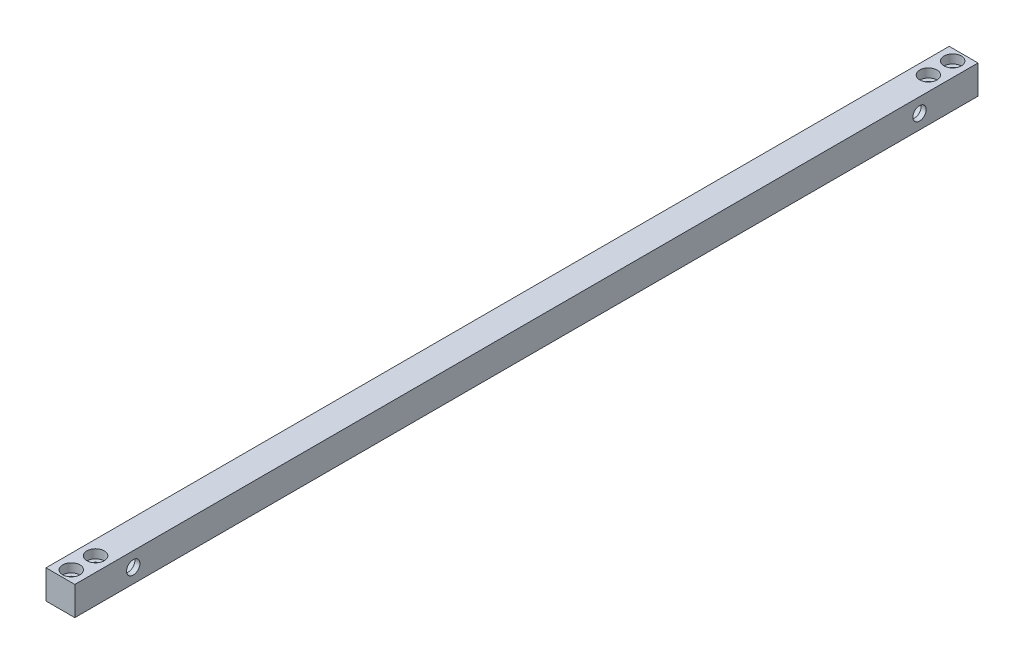
ISO-10303-21;
HEADER;
FILE_DESCRIPTION(('STEP AP214'),'2;1');
FILE_NAME('part.step','',(''),(''),'','','');
FILE_SCHEMA(('AUTOMOTIVE_DESIGN { 1 0 10303 214 1 1 1 1 }'));
ENDSEC;
DATA;
#1=APPLICATION_CONTEXT('core data for automotive mechanical design processes');
#2=APPLICATION_PROTOCOL_DEFINITION('international standard','automotive_design',2000,#1);
#3=PRODUCT_CONTEXT('',#1,'mechanical');
#4=PRODUCT('Part','Part','',(#3));
#5=PRODUCT_RELATED_PRODUCT_CATEGORY('part','',(#4));
#6=PRODUCT_DEFINITION_FORMATION('','',#4);
#7=PRODUCT_DEFINITION_CONTEXT('part definition',#1,'design');
#8=PRODUCT_DEFINITION('design','',#6,#7);
#9=PRODUCT_DEFINITION_SHAPE('','',#8);
#10=(LENGTH_UNIT() NAMED_UNIT(*) SI_UNIT(.MILLI.,.METRE.));
#11=(NAMED_UNIT(*) PLANE_ANGLE_UNIT() SI_UNIT($,.RADIAN.));
#12=(NAMED_UNIT(*) SI_UNIT($,.STERADIAN.) SOLID_ANGLE_UNIT());
#13=UNCERTAINTY_MEASURE_WITH_UNIT(LENGTH_MEASURE(1.E-05),#10,'distance_accuracy_value','');
#14=(GEOMETRIC_REPRESENTATION_CONTEXT(3) GLOBAL_UNCERTAINTY_ASSIGNED_CONTEXT((#13)) GLOBAL_UNIT_ASSIGNED_CONTEXT((#10,
#11,#12)) REPRESENTATION_CONTEXT('',''));
#15=CARTESIAN_POINT('',(0.,0.,0.));
#16=DIRECTION('',(0.,0.,1.));
#17=DIRECTION('',(1.,0.,0.));
#18=AXIS2_PLACEMENT_3D('',#15,#16,#17);
#19=CARTESIAN_POINT('',(0.,0.,497.84));
#20=DIRECTION('',(1.,0.,0.));
#21=DIRECTION('',(0.,1.,0.));
#22=AXIS2_PLACEMENT_3D('',#19,#20,#21);
#23=PLANE('',#22);
#24=CARTESIAN_POINT('',(0.,7.93749999999994,32.2199));
#25=DIRECTION('',(-1.,0.,0.));
#26=DIRECTION('',(0.,1.,0.));
#27=AXIS2_PLACEMENT_3D('',#24,#25,#26);
#28=CIRCLE('',#27,6.81989999999997);
#29=CARTESIAN_POINT('',(0.,14.7573999999999,32.2199));
#30=VERTEX_POINT('',#29);
#31=EDGE_CURVE('E162',#30,#30,#28,.T.);
#32=ORIENTED_EDGE('',*,*,#31,.F.);
#33=EDGE_LOOP('',(#32));
#34=FACE_BOUND('',#33,.T.);
#35=CARTESIAN_POINT('',(0.,7.9375,465.6201));
#36=DIRECTION('',(-1.,0.,0.));
#37=DIRECTION('',(0.,-1.,0.));
#38=AXIS2_PLACEMENT_3D('',#35,#36,#37);
#39=CIRCLE('',#38,6.81989999999997);
#40=CARTESIAN_POINT('',(0.,1.11760000000003,465.6201));
#41=VERTEX_POINT('',#40);
#42=EDGE_CURVE('E166',#41,#41,#39,.T.);
#43=ORIENTED_EDGE('',*,*,#42,.F.);
#44=EDGE_LOOP('',(#43));
#45=FACE_BOUND('',#44,.T.);
#46=DIRECTION('',(0.,-1.,0.));
#47=VECTOR('',#46,1.);
#48=CARTESIAN_POINT('',(0.,0.,0.));
#49=LINE('',#48,#47);
#50=CARTESIAN_POINT('',(0.,15.875,0.));
#51=VERTEX_POINT('',#50);
#52=CARTESIAN_POINT('',(0.,0.,0.));
#53=VERTEX_POINT('',#52);
#54=EDGE_CURVE('E103',#51,#53,#49,.T.);
#55=ORIENTED_EDGE('',*,*,#54,.T.);
#56=DIRECTION('',(0.,0.,-1.));
#57=VECTOR('',#56,1.);
#58=CARTESIAN_POINT('',(0.,0.,497.84));
#59=LINE('',#58,#57);
#60=CARTESIAN_POINT('',(0.,0.,497.84));
#61=VERTEX_POINT('',#60);
#62=EDGE_CURVE('E11',#61,#53,#59,.T.);
#63=ORIENTED_EDGE('',*,*,#62,.F.);
#64=DIRECTION('',(0.,-1.,0.));
#65=VECTOR('',#64,1.);
#66=CARTESIAN_POINT('',(0.,0.,497.84));
#67=LINE('',#66,#65);
#68=CARTESIAN_POINT('',(0.,15.875,497.84));
#69=VERTEX_POINT('',#68);
#70=EDGE_CURVE('E90',#69,#61,#67,.T.);
#71=ORIENTED_EDGE('',*,*,#70,.F.);
#72=DIRECTION('',(0.,0.,-1.));
#73=VECTOR('',#72,1.);
#74=CARTESIAN_POINT('',(0.,15.875,497.84));
#75=LINE('',#74,#73);
#76=EDGE_CURVE('E99',#69,#51,#75,.T.);
#77=ORIENTED_EDGE('',*,*,#76,.T.);
#78=EDGE_LOOP('',(#55,#63,#71,#77));
#79=FACE_BOUND('',#78,.T.);
#80=ADVANCED_FACE('F37',(#34,#45,#79),#23,.F.);
#81=CARTESIAN_POINT('',(0.,0.,497.84));
#82=DIRECTION('',(0.,1.,0.));
#83=DIRECTION('',(0.,0.,1.));
#84=AXIS2_PLACEMENT_3D('',#81,#82,#83);
#85=PLANE('',#84);
#86=CARTESIAN_POINT('',(7.93750000000004,0.,6.00000000000001));
#87=DIRECTION('',(0.,1.,0.));
#88=DIRECTION('',(0.,0.,1.));
#89=AXIS2_PLACEMENT_3D('',#86,#87,#88);
#90=CIRCLE('',#89,2.4892);
#91=CARTESIAN_POINT('',(7.93750000000004,0.,8.4892));
#92=VERTEX_POINT('',#91);
#93=EDGE_CURVE('E40',#92,#92,#90,.T.);
#94=ORIENTED_EDGE('',*,*,#93,.T.);
#95=EDGE_LOOP('',(#94));
#96=FACE_BOUND('',#95,.T.);
#97=CARTESIAN_POINT('',(7.93750000000004,0.,19.4000000000001));
#98=DIRECTION('',(0.,1.,0.));
#99=DIRECTION('',(0.,0.,1.));
#100=AXIS2_PLACEMENT_3D('',#97,#98,#99);
#101=CIRCLE('',#100,2.4892);
#102=CARTESIAN_POINT('',(7.93750000000004,0.,21.8892000000001));
#103=VERTEX_POINT('',#102);
#104=EDGE_CURVE('E125',#103,#103,#101,.T.);
#105=ORIENTED_EDGE('',*,*,#104,.T.);
#106=EDGE_LOOP('',(#105));
#107=FACE_BOUND('',#106,.T.);
#108=CARTESIAN_POINT('',(7.93749999999988,0.,491.84));
#109=DIRECTION('',(0.,1.,0.));
#110=DIRECTION('',(0.,0.,1.));
#111=AXIS2_PLACEMENT_3D('',#108,#109,#110);
#112=CIRCLE('',#111,2.4892);
#113=CARTESIAN_POINT('',(7.93749999999988,0.,494.3292));
#114=VERTEX_POINT('',#113);
#115=EDGE_CURVE('E121',#114,#114,#112,.T.);
#116=ORIENTED_EDGE('',*,*,#115,.T.);
#117=EDGE_LOOP('',(#116));
#118=FACE_BOUND('',#117,.T.);
#119=CARTESIAN_POINT('',(7.93749999999988,0.,478.44));
#120=DIRECTION('',(0.,1.,0.));
#121=DIRECTION('',(0.,0.,1.));
#122=AXIS2_PLACEMENT_3D('',#119,#120,#121);
#123=CIRCLE('',#122,2.4892);
#124=CARTESIAN_POINT('',(7.93749999999988,0.,480.9292));
#125=VERTEX_POINT('',#124);
#126=EDGE_CURVE('E117',#125,#125,#123,.T.);
#127=ORIENTED_EDGE('',*,*,#126,.T.);
#128=EDGE_LOOP('',(#127));
#129=FACE_BOUND('',#128,.T.);
#130=DIRECTION('',(1.,0.,0.));
#131=VECTOR('',#130,1.);
#132=CARTESIAN_POINT('',(0.,0.,0.));
#133=LINE('',#132,#131);
#134=CARTESIAN_POINT('',(15.875,0.,0.));
#135=VERTEX_POINT('',#134);
#136=EDGE_CURVE('E94',#53,#135,#133,.T.);
#137=ORIENTED_EDGE('',*,*,#136,.T.);
#138=DIRECTION('',(0.,0.,-1.));
#139=VECTOR('',#138,1.);
#140=CARTESIAN_POINT('',(15.875,0.,497.84));
#141=LINE('',#140,#139);
#142=CARTESIAN_POINT('',(15.875,0.,497.84));
#143=VERTEX_POINT('',#142);
#144=EDGE_CURVE('E46',#143,#135,#141,.T.);
#145=ORIENTED_EDGE('',*,*,#144,.F.);
#146=DIRECTION('',(1.,0.,0.));
#147=VECTOR('',#146,1.);
#148=CARTESIAN_POINT('',(0.,0.,497.84));
#149=LINE('',#148,#147);
#150=EDGE_CURVE('E85',#61,#143,#149,.T.);
#151=ORIENTED_EDGE('',*,*,#150,.F.);
#152=ORIENTED_EDGE('',*,*,#62,.T.);
#153=EDGE_LOOP('',(#137,#145,#151,#152));
#154=FACE_BOUND('',#153,.T.);
#155=ADVANCED_FACE('F93',(#96,#107,#118,#129,#154),#85,.F.);
#156=CARTESIAN_POINT('',(15.875,0.,497.84));
#157=DIRECTION('',(-1.,0.,0.));
#158=DIRECTION('',(0.,-1.,0.));
#159=AXIS2_PLACEMENT_3D('',#156,#157,#158);
#160=PLANE('',#159);
#161=CARTESIAN_POINT('',(15.875,7.93749999999994,32.2199));
#162=DIRECTION('',(-1.,0.,0.));
#163=DIRECTION('',(0.,-1.,0.));
#164=AXIS2_PLACEMENT_3D('',#161,#162,#163);
#165=CIRCLE('',#164,3.68299999999999);
#166=CARTESIAN_POINT('',(15.875,4.25449999999995,32.2199));
#167=VERTEX_POINT('',#166);
#168=EDGE_CURVE('E112',#167,#167,#165,.T.);
#169=ORIENTED_EDGE('',*,*,#168,.T.);
#170=EDGE_LOOP('',(#169));
#171=FACE_BOUND('',#170,.T.);
#172=CARTESIAN_POINT('',(15.875,7.9375,465.6201));
#173=DIRECTION('',(-1.,0.,0.));
#174=DIRECTION('',(0.,-1.,0.));
#175=AXIS2_PLACEMENT_3D('',#172,#173,#174);
#176=CIRCLE('',#175,3.68299999999999);
#177=CARTESIAN_POINT('',(15.875,4.25450000000001,465.6201));
#178=VERTEX_POINT('',#177);
#179=EDGE_CURVE('E159',#178,#178,#176,.T.);
#180=ORIENTED_EDGE('',*,*,#179,.T.);
#181=EDGE_LOOP('',(#180));
#182=FACE_BOUND('',#181,.T.);
#183=DIRECTION('',(0.,1.,0.));
#184=VECTOR('',#183,1.);
#185=CARTESIAN_POINT('',(15.875,0.,0.));
#186=LINE('',#185,#184);
#187=CARTESIAN_POINT('',(15.875,15.875,0.));
#188=VERTEX_POINT('',#187);
#189=EDGE_CURVE('E72',#135,#188,#186,.T.);
#190=ORIENTED_EDGE('',*,*,#189,.T.);
#191=DIRECTION('',(0.,0.,-1.));
#192=VECTOR('',#191,1.);
#193=CARTESIAN_POINT('',(15.875,15.875,497.84));
#194=LINE('',#193,#192);
#195=CARTESIAN_POINT('',(15.875,15.875,497.84));
#196=VERTEX_POINT('',#195);
#197=EDGE_CURVE('E95',#196,#188,#194,.T.);
#198=ORIENTED_EDGE('',*,*,#197,.F.);
#199=DIRECTION('',(0.,1.,0.));
#200=VECTOR('',#199,1.);
#201=CARTESIAN_POINT('',(15.875,0.,497.84));
#202=LINE('',#201,#200);
#203=EDGE_CURVE('E88',#143,#196,#202,.T.);
#204=ORIENTED_EDGE('',*,*,#203,.F.);
#205=ORIENTED_EDGE('',*,*,#144,.T.);
#206=EDGE_LOOP('',(#190,#198,#204,#205));
#207=FACE_BOUND('',#206,.T.);
#208=ADVANCED_FACE('F97',(#171,#182,#207),#160,.F.);
#209=CARTESIAN_POINT('',(0.,15.875,497.84));
#210=DIRECTION('',(0.,-1.,0.));
#211=DIRECTION('',(0.,0.,-1.));
#212=AXIS2_PLACEMENT_3D('',#209,#210,#211);
#213=PLANE('',#212);
#214=CARTESIAN_POINT('',(7.93750000000004,15.8749999999999,6.00000000000001));
#215=DIRECTION('',(0.,1.,0.));
#216=DIRECTION('',(0.,0.,1.));
#217=AXIS2_PLACEMENT_3D('',#214,#215,#216);
#218=CIRCLE('',#217,4.7625);
#219=CARTESIAN_POINT('',(7.93750000000004,15.8749999999999,10.7625));
#220=VERTEX_POINT('',#219);
#221=EDGE_CURVE('E398',#220,#220,#218,.T.);
#222=ORIENTED_EDGE('',*,*,#221,.F.);
#223=EDGE_LOOP('',(#222));
#224=FACE_BOUND('',#223,.T.);
#225=CARTESIAN_POINT('',(7.93750000000004,15.8749999999999,19.4000000000001));
#226=DIRECTION('',(0.,1.,0.));
#227=DIRECTION('',(0.,0.,1.));
#228=AXIS2_PLACEMENT_3D('',#225,#226,#227);
#229=CIRCLE('',#228,4.7625);
#230=CARTESIAN_POINT('',(7.93750000000004,15.8749999999999,24.1625000000001));
#231=VERTEX_POINT('',#230);
#232=EDGE_CURVE('E140',#231,#231,#229,.T.);
#233=ORIENTED_EDGE('',*,*,#232,.F.);
#234=EDGE_LOOP('',(#233));
#235=FACE_BOUND('',#234,.T.);
#236=CARTESIAN_POINT('',(7.93749999999988,15.8749999999999,491.84));
#237=DIRECTION('',(0.,1.,0.));
#238=DIRECTION('',(0.,0.,1.));
#239=AXIS2_PLACEMENT_3D('',#236,#237,#238);
#240=CIRCLE('',#239,4.7625);
#241=CARTESIAN_POINT('',(7.93749999999988,15.8749999999999,496.6025));
#242=VERTEX_POINT('',#241);
#243=EDGE_CURVE('E127',#242,#242,#240,.T.);
#244=ORIENTED_EDGE('',*,*,#243,.F.);
#245=EDGE_LOOP('',(#244));
#246=FACE_BOUND('',#245,.T.);
#247=CARTESIAN_POINT('',(7.93749999999988,15.8749999999999,478.44));
#248=DIRECTION('',(0.,1.,0.));
#249=DIRECTION('',(0.,0.,1.));
#250=AXIS2_PLACEMENT_3D('',#247,#248,#249);
#251=CIRCLE('',#250,4.7625);
#252=CARTESIAN_POINT('',(7.93749999999988,15.8749999999999,483.2025));
#253=VERTEX_POINT('',#252);
#254=EDGE_CURVE('E123',#253,#253,#251,.T.);
#255=ORIENTED_EDGE('',*,*,#254,.F.);
#256=EDGE_LOOP('',(#255));
#257=FACE_BOUND('',#256,.T.);
#258=DIRECTION('',(-1.,0.,0.));
#259=VECTOR('',#258,1.);
#260=CARTESIAN_POINT('',(0.,15.875,0.));
#261=LINE('',#260,#259);
#262=EDGE_CURVE('E78',#188,#51,#261,.T.);
#263=ORIENTED_EDGE('',*,*,#262,.T.);
#264=ORIENTED_EDGE('',*,*,#76,.F.);
#265=DIRECTION('',(-1.,0.,0.));
#266=VECTOR('',#265,1.);
#267=CARTESIAN_POINT('',(0.,15.875,497.84));
#268=LINE('',#267,#266);
#269=EDGE_CURVE('E55',#196,#69,#268,.T.);
#270=ORIENTED_EDGE('',*,*,#269,.F.);
#271=ORIENTED_EDGE('',*,*,#197,.T.);
#272=EDGE_LOOP('',(#263,#264,#270,#271));
#273=FACE_BOUND('',#272,.T.);
#274=ADVANCED_FACE('F191',(#224,#235,#246,#257,#273),#213,.F.);
#275=CARTESIAN_POINT('',(0.,0.,497.84));
#276=DIRECTION('',(0.,0.,-1.));
#277=DIRECTION('',(-1.,0.,0.));
#278=AXIS2_PLACEMENT_3D('',#275,#276,#277);
#279=PLANE('',#278);
#280=ORIENTED_EDGE('',*,*,#70,.T.);
#281=ORIENTED_EDGE('',*,*,#150,.T.);
#282=ORIENTED_EDGE('',*,*,#203,.T.);
#283=ORIENTED_EDGE('',*,*,#269,.T.);
#284=EDGE_LOOP('',(#280,#281,#282,#283));
#285=FACE_BOUND('',#284,.T.);
#286=ADVANCED_FACE('F86',(#285),#279,.F.);
#287=CARTESIAN_POINT('',(0.,0.,0.));
#288=DIRECTION('',(0.,0.,-1.));
#289=DIRECTION('',(-1.,0.,0.));
#290=AXIS2_PLACEMENT_3D('',#287,#288,#289);
#291=PLANE('',#290);
#292=ORIENTED_EDGE('',*,*,#54,.F.);
#293=ORIENTED_EDGE('',*,*,#262,.F.);
#294=ORIENTED_EDGE('',*,*,#189,.F.);
#295=ORIENTED_EDGE('',*,*,#136,.F.);
#296=EDGE_LOOP('',(#292,#293,#294,#295));
#297=FACE_BOUND('',#296,.T.);
#298=ADVANCED_FACE('F181',(#297),#291,.T.);
#299=CARTESIAN_POINT('',(13.08608,7.9375,465.6201));
#300=DIRECTION('',(-1.,0.,0.));
#301=DIRECTION('',(0.,-1.,0.));
#302=AXIS2_PLACEMENT_3D('',#299,#300,#301);
#303=CYLINDRICAL_SURFACE('',#302,6.81989999999997);
#304=CARTESIAN_POINT('',(13.08608,7.9375,465.6201));
#305=DIRECTION('',(-1.,0.,0.));
#306=DIRECTION('',(0.,-1.,0.));
#307=AXIS2_PLACEMENT_3D('',#304,#305,#306);
#308=CIRCLE('',#307,6.81989999999997);
#309=CARTESIAN_POINT('',(13.08608,1.11760000000003,465.6201));
#310=VERTEX_POINT('',#309);
#311=EDGE_CURVE('E106',#310,#310,#308,.T.);
#312=ORIENTED_EDGE('',*,*,#311,.F.);
#313=EDGE_LOOP('',(#312));
#314=FACE_BOUND('',#313,.T.);
#315=ORIENTED_EDGE('',*,*,#42,.T.);
#316=EDGE_LOOP('',(#315));
#317=FACE_BOUND('',#316,.T.);
#318=ADVANCED_FACE('F174',(#314,#317),#303,.F.);
#319=CARTESIAN_POINT('',(13.08608,7.9375,465.6201));
#320=DIRECTION('',(-1.,0.,0.));
#321=DIRECTION('',(0.,-1.,0.));
#322=AXIS2_PLACEMENT_3D('',#319,#320,#321);
#323=PLANE('',#322);
#324=CARTESIAN_POINT('',(13.08608,7.9375,465.6201));
#325=DIRECTION('',(-1.,0.,0.));
#326=DIRECTION('',(0.,0.,1.));
#327=AXIS2_PLACEMENT_3D('',#324,#325,#326);
#328=CIRCLE('',#327,3.68299999999999);
#329=CARTESIAN_POINT('',(13.08608,7.9375,469.3031));
#330=VERTEX_POINT('',#329);
#331=EDGE_CURVE('E115',#330,#330,#328,.T.);
#332=ORIENTED_EDGE('',*,*,#331,.F.);
#333=EDGE_LOOP('',(#332));
#334=FACE_BOUND('',#333,.T.);
#335=ORIENTED_EDGE('',*,*,#311,.T.);
#336=EDGE_LOOP('',(#335));
#337=FACE_BOUND('',#336,.T.);
#338=ADVANCED_FACE('F188',(#334,#337),#323,.T.);
#339=CARTESIAN_POINT('',(13.08608,7.93749999999994,32.2199));
#340=DIRECTION('',(-1.,0.,0.));
#341=DIRECTION('',(0.,-1.,0.));
#342=AXIS2_PLACEMENT_3D('',#339,#340,#341);
#343=CYLINDRICAL_SURFACE('',#342,6.81989999999997);
#344=CARTESIAN_POINT('',(13.08608,7.93749999999994,32.2199));
#345=DIRECTION('',(-1.,0.,0.));
#346=DIRECTION('',(0.,1.,0.));
#347=AXIS2_PLACEMENT_3D('',#344,#345,#346);
#348=CIRCLE('',#347,6.81989999999997);
#349=CARTESIAN_POINT('',(13.08608,14.7573999999999,32.2199));
#350=VERTEX_POINT('',#349);
#351=EDGE_CURVE('E163',#350,#350,#348,.T.);
#352=ORIENTED_EDGE('',*,*,#351,.F.);
#353=EDGE_LOOP('',(#352));
#354=FACE_BOUND('',#353,.T.);
#355=ORIENTED_EDGE('',*,*,#31,.T.);
#356=EDGE_LOOP('',(#355));
#357=FACE_BOUND('',#356,.T.);
#358=ADVANCED_FACE('F234',(#354,#357),#343,.F.);
#359=CARTESIAN_POINT('',(13.08608,7.93749999999994,32.2199));
#360=DIRECTION('',(1.,0.,0.));
#361=DIRECTION('',(0.,1.,0.));
#362=AXIS2_PLACEMENT_3D('',#359,#360,#361);
#363=PLANE('',#362);
#364=CARTESIAN_POINT('',(13.08608,7.93749999999994,32.2199));
#365=DIRECTION('',(-1.,0.,0.));
#366=DIRECTION('',(0.,0.,1.));
#367=AXIS2_PLACEMENT_3D('',#364,#365,#366);
#368=CIRCLE('',#367,3.68299999999999);
#369=CARTESIAN_POINT('',(13.08608,7.93749999999994,35.9029));
#370=VERTEX_POINT('',#369);
#371=EDGE_CURVE('E116',#370,#370,#368,.T.);
#372=ORIENTED_EDGE('',*,*,#371,.F.);
#373=EDGE_LOOP('',(#372));
#374=FACE_BOUND('',#373,.T.);
#375=ORIENTED_EDGE('',*,*,#351,.T.);
#376=EDGE_LOOP('',(#375));
#377=FACE_BOUND('',#376,.T.);
#378=ADVANCED_FACE('F230',(#374,#377),#363,.F.);
#379=CARTESIAN_POINT('',(13.08608,7.9375,465.6201));
#380=DIRECTION('',(-1.,0.,0.));
#381=DIRECTION('',(0.,0.,1.));
#382=AXIS2_PLACEMENT_3D('',#379,#380,#381);
#383=CYLINDRICAL_SURFACE('',#382,3.68299999999999);
#384=ORIENTED_EDGE('',*,*,#331,.T.);
#385=EDGE_LOOP('',(#384));
#386=FACE_BOUND('',#385,.T.);
#387=ORIENTED_EDGE('',*,*,#179,.F.);
#388=EDGE_LOOP('',(#387));
#389=FACE_BOUND('',#388,.T.);
#390=ADVANCED_FACE('F223',(#386,#389),#383,.F.);
#391=CARTESIAN_POINT('',(13.08608,7.93749999999994,32.2199));
#392=DIRECTION('',(-1.,0.,0.));
#393=DIRECTION('',(0.,0.,1.));
#394=AXIS2_PLACEMENT_3D('',#391,#392,#393);
#395=CYLINDRICAL_SURFACE('',#394,3.68299999999999);
#396=ORIENTED_EDGE('',*,*,#371,.T.);
#397=EDGE_LOOP('',(#396));
#398=FACE_BOUND('',#397,.T.);
#399=ORIENTED_EDGE('',*,*,#168,.F.);
#400=EDGE_LOOP('',(#399));
#401=FACE_BOUND('',#400,.T.);
#402=ADVANCED_FACE('F213',(#398,#401),#395,.F.);
#403=CARTESIAN_POINT('',(7.93749999999988,15.8749999999999,478.44));
#404=DIRECTION('',(0.,1.,0.));
#405=DIRECTION('',(0.,0.,1.));
#406=AXIS2_PLACEMENT_3D('',#403,#404,#405);
#407=CYLINDRICAL_SURFACE('',#406,2.4892);
#408=CARTESIAN_POINT('',(7.93749999999988,11.0489999999999,478.44));
#409=DIRECTION('',(0.,1.,0.));
#410=DIRECTION('',(0.,0.,1.));
#411=AXIS2_PLACEMENT_3D('',#408,#409,#410);
#412=CIRCLE('',#411,2.4892);
#413=CARTESIAN_POINT('',(7.93749999999988,11.0489999999999,480.9292));
#414=VERTEX_POINT('',#413);
#415=EDGE_CURVE('E120',#414,#414,#412,.T.);
#416=ORIENTED_EDGE('',*,*,#415,.T.);
#417=EDGE_LOOP('',(#416));
#418=FACE_BOUND('',#417,.T.);
#419=ORIENTED_EDGE('',*,*,#126,.F.);
#420=EDGE_LOOP('',(#419));
#421=FACE_BOUND('',#420,.T.);
#422=ADVANCED_FACE('F210',(#418,#421),#407,.F.);
#423=CARTESIAN_POINT('',(10.4266999999999,11.0489999999999,478.44));
#424=DIRECTION('',(0.,-1.,0.));
#425=DIRECTION('',(0.,0.,-1.));
#426=AXIS2_PLACEMENT_3D('',#423,#424,#425);
#427=PLANE('',#426);
#428=ORIENTED_EDGE('',*,*,#415,.F.);
#429=EDGE_LOOP('',(#428));
#430=FACE_BOUND('',#429,.T.);
#431=CARTESIAN_POINT('',(7.93749999999988,11.0489999999999,478.44));
#432=DIRECTION('',(0.,1.,0.));
#433=DIRECTION('',(0.,0.,1.));
#434=AXIS2_PLACEMENT_3D('',#431,#432,#433);
#435=CIRCLE('',#434,4.7625);
#436=CARTESIAN_POINT('',(7.93749999999988,11.0489999999999,483.2025));
#437=VERTEX_POINT('',#436);
#438=EDGE_CURVE('E150',#437,#437,#435,.T.);
#439=ORIENTED_EDGE('',*,*,#438,.T.);
#440=EDGE_LOOP('',(#439));
#441=FACE_BOUND('',#440,.T.);
#442=ADVANCED_FACE('F212',(#430,#441),#427,.F.);
#443=CARTESIAN_POINT('',(7.93749999999988,15.8749999999999,478.44));
#444=DIRECTION('',(0.,1.,0.));
#445=DIRECTION('',(0.,0.,1.));
#446=AXIS2_PLACEMENT_3D('',#443,#444,#445);
#447=CYLINDRICAL_SURFACE('',#446,4.7625);
#448=ORIENTED_EDGE('',*,*,#438,.F.);
#449=EDGE_LOOP('',(#448));
#450=FACE_BOUND('',#449,.T.);
#451=ORIENTED_EDGE('',*,*,#254,.T.);
#452=EDGE_LOOP('',(#451));
#453=FACE_BOUND('',#452,.T.);
#454=ADVANCED_FACE('F220',(#450,#453),#447,.F.);
#455=CARTESIAN_POINT('',(7.93749999999988,15.8749999999999,491.84));
#456=DIRECTION('',(0.,1.,0.));
#457=DIRECTION('',(0.,0.,1.));
#458=AXIS2_PLACEMENT_3D('',#455,#456,#457);
#459=CYLINDRICAL_SURFACE('',#458,2.4892);
#460=CARTESIAN_POINT('',(7.93749999999988,11.0489999999999,491.84));
#461=DIRECTION('',(0.,1.,0.));
#462=DIRECTION('',(0.,0.,1.));
#463=AXIS2_PLACEMENT_3D('',#460,#461,#462);
#464=CIRCLE('',#463,2.4892);
#465=CARTESIAN_POINT('',(7.93749999999988,11.0489999999999,494.3292));
#466=VERTEX_POINT('',#465);
#467=EDGE_CURVE('E124',#466,#466,#464,.T.);
#468=ORIENTED_EDGE('',*,*,#467,.T.);
#469=EDGE_LOOP('',(#468));
#470=FACE_BOUND('',#469,.T.);
#471=ORIENTED_EDGE('',*,*,#115,.F.);
#472=EDGE_LOOP('',(#471));
#473=FACE_BOUND('',#472,.T.);
#474=ADVANCED_FACE('F287',(#470,#473),#459,.F.);
#475=CARTESIAN_POINT('',(10.4266999999999,11.0489999999999,491.84));
#476=DIRECTION('',(0.,-1.,0.));
#477=DIRECTION('',(0.,0.,-1.));
#478=AXIS2_PLACEMENT_3D('',#475,#476,#477);
#479=PLANE('',#478);
#480=ORIENTED_EDGE('',*,*,#467,.F.);
#481=EDGE_LOOP('',(#480));
#482=FACE_BOUND('',#481,.T.);
#483=CARTESIAN_POINT('',(7.93749999999988,11.0489999999999,491.84));
#484=DIRECTION('',(0.,1.,0.));
#485=DIRECTION('',(0.,0.,1.));
#486=AXIS2_PLACEMENT_3D('',#483,#484,#485);
#487=CIRCLE('',#486,4.7625);
#488=CARTESIAN_POINT('',(7.93749999999988,11.0489999999999,496.6025));
#489=VERTEX_POINT('',#488);
#490=EDGE_CURVE('E132',#489,#489,#487,.T.);
#491=ORIENTED_EDGE('',*,*,#490,.T.);
#492=EDGE_LOOP('',(#491));
#493=FACE_BOUND('',#492,.T.);
#494=ADVANCED_FACE('F296',(#482,#493),#479,.F.);
#495=CARTESIAN_POINT('',(7.93749999999988,15.8749999999999,491.84));
#496=DIRECTION('',(0.,1.,0.));
#497=DIRECTION('',(0.,0.,1.));
#498=AXIS2_PLACEMENT_3D('',#495,#496,#497);
#499=CYLINDRICAL_SURFACE('',#498,4.7625);
#500=ORIENTED_EDGE('',*,*,#490,.F.);
#501=EDGE_LOOP('',(#500));
#502=FACE_BOUND('',#501,.T.);
#503=ORIENTED_EDGE('',*,*,#243,.T.);
#504=EDGE_LOOP('',(#503));
#505=FACE_BOUND('',#504,.T.);
#506=ADVANCED_FACE('F306',(#502,#505),#499,.F.);
#507=CARTESIAN_POINT('',(7.93750000000004,15.8749999999999,19.4000000000001));
#508=DIRECTION('',(0.,1.,0.));
#509=DIRECTION('',(0.,0.,1.));
#510=AXIS2_PLACEMENT_3D('',#507,#508,#509);
#511=CYLINDRICAL_SURFACE('',#510,2.4892);
#512=CARTESIAN_POINT('',(7.93750000000004,11.0489999999999,19.4000000000001));
#513=DIRECTION('',(0.,1.,0.));
#514=DIRECTION('',(0.,0.,1.));
#515=AXIS2_PLACEMENT_3D('',#512,#513,#514);
#516=CIRCLE('',#515,2.4892);
#517=CARTESIAN_POINT('',(7.93750000000004,11.0489999999999,21.8892000000001));
#518=VERTEX_POINT('',#517);
#519=EDGE_CURVE('E128',#518,#518,#516,.T.);
#520=ORIENTED_EDGE('',*,*,#519,.T.);
#521=EDGE_LOOP('',(#520));
#522=FACE_BOUND('',#521,.T.);
#523=ORIENTED_EDGE('',*,*,#104,.F.);
#524=EDGE_LOOP('',(#523));
#525=FACE_BOUND('',#524,.T.);
#526=ADVANCED_FACE('F315',(#522,#525),#511,.F.);
#527=CARTESIAN_POINT('',(10.4267,11.0489999999999,19.4000000000001));
#528=DIRECTION('',(0.,-1.,0.));
#529=DIRECTION('',(0.,0.,-1.));
#530=AXIS2_PLACEMENT_3D('',#527,#528,#529);
#531=PLANE('',#530);
#532=ORIENTED_EDGE('',*,*,#519,.F.);
#533=EDGE_LOOP('',(#532));
#534=FACE_BOUND('',#533,.T.);
#535=CARTESIAN_POINT('',(7.93750000000004,11.0489999999999,19.4000000000001));
#536=DIRECTION('',(0.,1.,0.));
#537=DIRECTION('',(0.,0.,1.));
#538=AXIS2_PLACEMENT_3D('',#535,#536,#537);
#539=CIRCLE('',#538,4.7625);
#540=CARTESIAN_POINT('',(7.93750000000004,11.0489999999999,24.1625000000001));
#541=VERTEX_POINT('',#540);
#542=EDGE_CURVE('E135',#541,#541,#539,.T.);
#543=ORIENTED_EDGE('',*,*,#542,.T.);
#544=EDGE_LOOP('',(#543));
#545=FACE_BOUND('',#544,.T.);
#546=ADVANCED_FACE('F339',(#534,#545),#531,.F.);
#547=CARTESIAN_POINT('',(7.93750000000004,15.8749999999999,19.4000000000001));
#548=DIRECTION('',(0.,1.,0.));
#549=DIRECTION('',(0.,0.,1.));
#550=AXIS2_PLACEMENT_3D('',#547,#548,#549);
#551=CYLINDRICAL_SURFACE('',#550,4.7625);
#552=ORIENTED_EDGE('',*,*,#542,.F.);
#553=EDGE_LOOP('',(#552));
#554=FACE_BOUND('',#553,.T.);
#555=ORIENTED_EDGE('',*,*,#232,.T.);
#556=EDGE_LOOP('',(#555));
#557=FACE_BOUND('',#556,.T.);
#558=ADVANCED_FACE('F348',(#554,#557),#551,.F.);
#559=CARTESIAN_POINT('',(7.93750000000004,15.8749999999999,6.00000000000001));
#560=DIRECTION('',(0.,1.,0.));
#561=DIRECTION('',(0.,0.,1.));
#562=AXIS2_PLACEMENT_3D('',#559,#560,#561);
#563=CYLINDRICAL_SURFACE('',#562,2.4892);
#564=CARTESIAN_POINT('',(7.93750000000004,11.0489999999999,6.00000000000001));
#565=DIRECTION('',(0.,1.,0.));
#566=DIRECTION('',(0.,0.,1.));
#567=AXIS2_PLACEMENT_3D('',#564,#565,#566);
#568=CIRCLE('',#567,2.4892);
#569=CARTESIAN_POINT('',(7.93750000000004,11.0489999999999,8.4892));
#570=VERTEX_POINT('',#569);
#571=EDGE_CURVE('E400',#570,#570,#568,.T.);
#572=ORIENTED_EDGE('',*,*,#571,.T.);
#573=EDGE_LOOP('',(#572));
#574=FACE_BOUND('',#573,.T.);
#575=ORIENTED_EDGE('',*,*,#93,.F.);
#576=EDGE_LOOP('',(#575));
#577=FACE_BOUND('',#576,.T.);
#578=ADVANCED_FACE('F358',(#574,#577),#563,.F.);
#579=CARTESIAN_POINT('',(10.4267,11.0489999999999,6.00000000000001));
#580=DIRECTION('',(0.,-1.,0.));
#581=DIRECTION('',(0.,0.,-1.));
#582=AXIS2_PLACEMENT_3D('',#579,#580,#581);
#583=PLANE('',#582);
#584=ORIENTED_EDGE('',*,*,#571,.F.);
#585=EDGE_LOOP('',(#584));
#586=FACE_BOUND('',#585,.T.);
#587=CARTESIAN_POINT('',(7.93750000000004,11.0489999999999,6.00000000000001));
#588=DIRECTION('',(0.,1.,0.));
#589=DIRECTION('',(0.,0.,1.));
#590=AXIS2_PLACEMENT_3D('',#587,#588,#589);
#591=CIRCLE('',#590,4.7625);
#592=CARTESIAN_POINT('',(7.93750000000004,11.0489999999999,10.7625));
#593=VERTEX_POINT('',#592);
#594=EDGE_CURVE('E395',#593,#593,#591,.T.);
#595=ORIENTED_EDGE('',*,*,#594,.T.);
#596=EDGE_LOOP('',(#595));
#597=FACE_BOUND('',#596,.T.);
#598=ADVANCED_FACE('F368',(#586,#597),#583,.F.);
#599=CARTESIAN_POINT('',(7.93750000000004,15.8749999999999,6.00000000000001));
#600=DIRECTION('',(0.,1.,0.));
#601=DIRECTION('',(0.,0.,1.));
#602=AXIS2_PLACEMENT_3D('',#599,#600,#601);
#603=CYLINDRICAL_SURFACE('',#602,4.7625);
#604=ORIENTED_EDGE('',*,*,#594,.F.);
#605=EDGE_LOOP('',(#604));
#606=FACE_BOUND('',#605,.T.);
#607=ORIENTED_EDGE('',*,*,#221,.T.);
#608=EDGE_LOOP('',(#607));
#609=FACE_BOUND('',#608,.T.);
#610=ADVANCED_FACE('F378',(#606,#609),#603,.F.);
#611=CLOSED_SHELL('',(#80,#155,#208,#274,#286,#298,#318,#338,#358,#378,#390,#402,#422,#442,#454,
#474,#494,#506,#526,#546,#558,#578,#598,#610));
#612=MANIFOLD_SOLID_BREP('B2',#611);
#613=ADVANCED_BREP_SHAPE_REPRESENTATION('',(#18,#612),#14);
#614=SHAPE_DEFINITION_REPRESENTATION(#9,#613);
ENDSEC;
END-ISO-10303-21;
